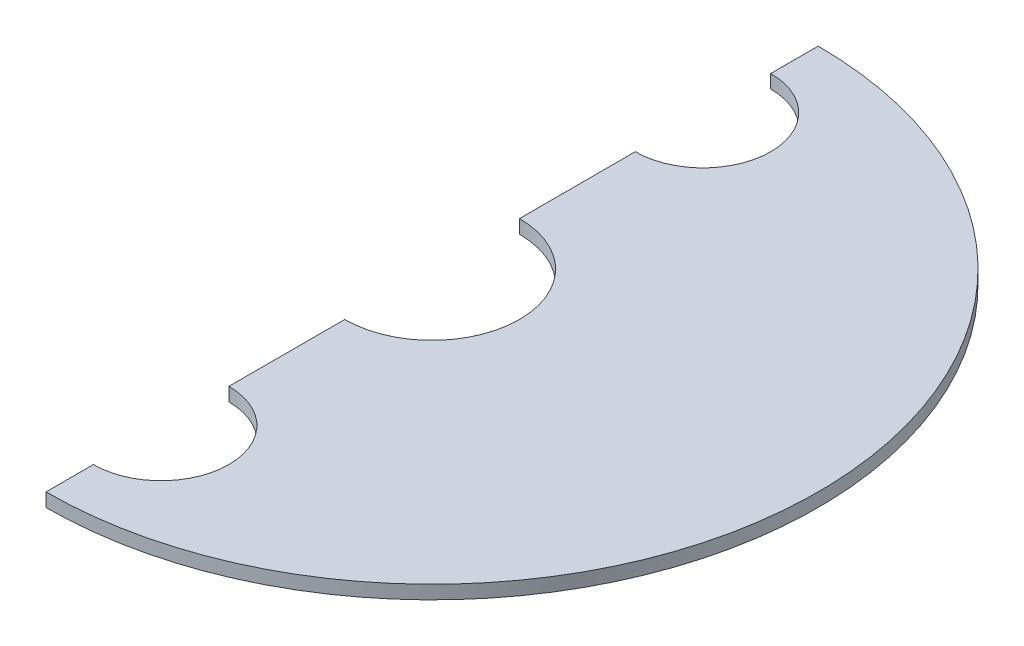
ISO-10303-21;
HEADER;
FILE_DESCRIPTION(('STEP AP214'),'2;1');
FILE_NAME('part.step','',(''),(''),'','','');
FILE_SCHEMA(('AUTOMOTIVE_DESIGN { 1 0 10303 214 1 1 1 1 }'));
ENDSEC;
DATA;
#1=APPLICATION_CONTEXT('core data for automotive mechanical design processes');
#2=APPLICATION_PROTOCOL_DEFINITION('international standard','automotive_design',2000,#1);
#3=PRODUCT_CONTEXT('',#1,'mechanical');
#4=PRODUCT('Part','Part','',(#3));
#5=PRODUCT_RELATED_PRODUCT_CATEGORY('part','',(#4));
#6=PRODUCT_DEFINITION_FORMATION('','',#4);
#7=PRODUCT_DEFINITION_CONTEXT('part definition',#1,'design');
#8=PRODUCT_DEFINITION('design','',#6,#7);
#9=PRODUCT_DEFINITION_SHAPE('','',#8);
#10=(LENGTH_UNIT() NAMED_UNIT(*) SI_UNIT(.MILLI.,.METRE.));
#11=(NAMED_UNIT(*) PLANE_ANGLE_UNIT() SI_UNIT($,.RADIAN.));
#12=(NAMED_UNIT(*) SI_UNIT($,.STERADIAN.) SOLID_ANGLE_UNIT());
#13=UNCERTAINTY_MEASURE_WITH_UNIT(LENGTH_MEASURE(1.E-05),#10,'distance_accuracy_value','');
#14=(GEOMETRIC_REPRESENTATION_CONTEXT(3) GLOBAL_UNCERTAINTY_ASSIGNED_CONTEXT((#13)) GLOBAL_UNIT_ASSIGNED_CONTEXT((#10,
#11,#12)) REPRESENTATION_CONTEXT('',''));
#15=CARTESIAN_POINT('',(0.,0.,0.));
#16=DIRECTION('',(0.,0.,1.));
#17=DIRECTION('',(1.,0.,0.));
#18=AXIS2_PLACEMENT_3D('',#15,#16,#17);
#19=CARTESIAN_POINT('',(0.,1.,-20.));
#20=DIRECTION('',(0.,-1.,0.));
#21=DIRECTION('',(0.,0.,-1.));
#22=AXIS2_PLACEMENT_3D('',#19,#20,#21);
#23=CYLINDRICAL_SURFACE('',#22,5.);
#24=CARTESIAN_POINT('',(0.,0.,-20.));
#25=DIRECTION('',(0.,1.,0.));
#26=DIRECTION('',(0.,0.,1.));
#27=AXIS2_PLACEMENT_3D('',#24,#25,#26);
#28=CIRCLE('',#27,5.);
#29=CARTESIAN_POINT('',(0.,0.,-15.));
#30=VERTEX_POINT('',#29);
#31=CARTESIAN_POINT('',(0.,0.,-25.));
#32=VERTEX_POINT('',#31);
#33=EDGE_CURVE('E138',#30,#32,#28,.T.);
#34=ORIENTED_EDGE('',*,*,#33,.F.);
#35=DIRECTION('',(0.,-1.,0.));
#36=VECTOR('',#35,1.);
#37=CARTESIAN_POINT('',(0.,1.,-15.));
#38=LINE('',#37,#36);
#39=CARTESIAN_POINT('',(0.,1.,-15.));
#40=VERTEX_POINT('',#39);
#41=EDGE_CURVE('E13',#40,#30,#38,.T.);
#42=ORIENTED_EDGE('',*,*,#41,.F.);
#43=CARTESIAN_POINT('',(0.,1.,-20.));
#44=DIRECTION('',(0.,1.,0.));
#45=DIRECTION('',(0.,0.,1.));
#46=AXIS2_PLACEMENT_3D('',#43,#44,#45);
#47=CIRCLE('',#46,5.);
#48=CARTESIAN_POINT('',(0.,1.,-25.));
#49=VERTEX_POINT('',#48);
#50=EDGE_CURVE('E157',#40,#49,#47,.T.);
#51=ORIENTED_EDGE('',*,*,#50,.T.);
#52=DIRECTION('',(0.,-1.,0.));
#53=VECTOR('',#52,1.);
#54=CARTESIAN_POINT('',(0.,1.,-25.));
#55=LINE('',#54,#53);
#56=EDGE_CURVE('E98',#49,#32,#55,.T.);
#57=ORIENTED_EDGE('',*,*,#56,.T.);
#58=EDGE_LOOP('',(#34,#42,#51,#57));
#59=FACE_BOUND('',#58,.T.);
#60=ADVANCED_FACE('F47',(#59),#23,.F.);
#61=CARTESIAN_POINT('',(0.,1.,0.));
#62=DIRECTION('',(-1.,0.,0.));
#63=DIRECTION('',(0.,0.,1.));
#64=AXIS2_PLACEMENT_3D('',#61,#62,#63);
#65=PLANE('',#64);
#66=DIRECTION('',(0.,0.,-1.));
#67=VECTOR('',#66,1.);
#68=CARTESIAN_POINT('',(0.,0.,0.));
#69=LINE('',#68,#67);
#70=CARTESIAN_POINT('',(0.,0.,-6.45));
#71=VERTEX_POINT('',#70);
#72=EDGE_CURVE('E141',#71,#30,#69,.T.);
#73=ORIENTED_EDGE('',*,*,#72,.F.);
#74=DIRECTION('',(0.,-1.,0.));
#75=VECTOR('',#74,1.);
#76=CARTESIAN_POINT('',(0.,1.,-6.45));
#77=LINE('',#76,#75);
#78=CARTESIAN_POINT('',(0.,1.,-6.45));
#79=VERTEX_POINT('',#78);
#80=EDGE_CURVE('E55',#79,#71,#77,.T.);
#81=ORIENTED_EDGE('',*,*,#80,.F.);
#82=DIRECTION('',(0.,0.,-1.));
#83=VECTOR('',#82,1.);
#84=CARTESIAN_POINT('',(0.,1.,0.));
#85=LINE('',#84,#83);
#86=EDGE_CURVE('E185',#79,#40,#85,.T.);
#87=ORIENTED_EDGE('',*,*,#86,.T.);
#88=ORIENTED_EDGE('',*,*,#41,.T.);
#89=EDGE_LOOP('',(#73,#81,#87,#88));
#90=FACE_BOUND('',#89,.T.);
#91=ADVANCED_FACE('F174',(#90),#65,.T.);
#92=CARTESIAN_POINT('',(0.,1.,0.));
#93=DIRECTION('',(0.,-1.,0.));
#94=DIRECTION('',(0.,0.,-1.));
#95=AXIS2_PLACEMENT_3D('',#92,#93,#94);
#96=CYLINDRICAL_SURFACE('',#95,6.45);
#97=CARTESIAN_POINT('',(0.,0.,0.));
#98=DIRECTION('',(0.,1.,0.));
#99=DIRECTION('',(0.,0.,1.));
#100=AXIS2_PLACEMENT_3D('',#97,#98,#99);
#101=CIRCLE('',#100,6.45);
#102=CARTESIAN_POINT('',(0.,0.,6.45));
#103=VERTEX_POINT('',#102);
#104=EDGE_CURVE('E144',#103,#71,#101,.T.);
#105=ORIENTED_EDGE('',*,*,#104,.F.);
#106=DIRECTION('',(0.,-1.,0.));
#107=VECTOR('',#106,1.);
#108=CARTESIAN_POINT('',(0.,1.,6.45));
#109=LINE('',#108,#107);
#110=CARTESIAN_POINT('',(0.,1.,6.45));
#111=VERTEX_POINT('',#110);
#112=EDGE_CURVE('E163',#111,#103,#109,.T.);
#113=ORIENTED_EDGE('',*,*,#112,.F.);
#114=CARTESIAN_POINT('',(0.,1.,0.));
#115=DIRECTION('',(0.,1.,0.));
#116=DIRECTION('',(0.,0.,1.));
#117=AXIS2_PLACEMENT_3D('',#114,#115,#116);
#118=CIRCLE('',#117,6.45);
#119=EDGE_CURVE('E170',#111,#79,#118,.T.);
#120=ORIENTED_EDGE('',*,*,#119,.T.);
#121=ORIENTED_EDGE('',*,*,#80,.T.);
#122=EDGE_LOOP('',(#105,#113,#120,#121));
#123=FACE_BOUND('',#122,.T.);
#124=ADVANCED_FACE('F168',(#123),#96,.F.);
#125=CARTESIAN_POINT('',(0.,1.,0.));
#126=DIRECTION('',(1.,0.,0.));
#127=DIRECTION('',(0.,0.,-1.));
#128=AXIS2_PLACEMENT_3D('',#125,#126,#127);
#129=PLANE('',#128);
#130=DIRECTION('',(0.,0.,1.));
#131=VECTOR('',#130,1.);
#132=CARTESIAN_POINT('',(0.,0.,0.));
#133=LINE('',#132,#131);
#134=CARTESIAN_POINT('',(0.,0.,15.));
#135=VERTEX_POINT('',#134);
#136=EDGE_CURVE('E147',#103,#135,#133,.T.);
#137=ORIENTED_EDGE('',*,*,#136,.T.);
#138=DIRECTION('',(0.,-1.,0.));
#139=VECTOR('',#138,1.);
#140=CARTESIAN_POINT('',(0.,1.,15.));
#141=LINE('',#140,#139);
#142=CARTESIAN_POINT('',(0.,1.,15.));
#143=VERTEX_POINT('',#142);
#144=EDGE_CURVE('E161',#143,#135,#141,.T.);
#145=ORIENTED_EDGE('',*,*,#144,.F.);
#146=DIRECTION('',(0.,0.,1.));
#147=VECTOR('',#146,1.);
#148=CARTESIAN_POINT('',(0.,1.,0.));
#149=LINE('',#148,#147);
#150=EDGE_CURVE('E183',#111,#143,#149,.T.);
#151=ORIENTED_EDGE('',*,*,#150,.F.);
#152=ORIENTED_EDGE('',*,*,#112,.T.);
#153=EDGE_LOOP('',(#137,#145,#151,#152));
#154=FACE_BOUND('',#153,.T.);
#155=ADVANCED_FACE('F181',(#154),#129,.F.);
#156=CARTESIAN_POINT('',(0.,1.,20.));
#157=DIRECTION('',(0.,-1.,0.));
#158=DIRECTION('',(0.,0.,-1.));
#159=AXIS2_PLACEMENT_3D('',#156,#157,#158);
#160=CYLINDRICAL_SURFACE('',#159,5.);
#161=CARTESIAN_POINT('',(0.,0.,20.));
#162=DIRECTION('',(0.,1.,0.));
#163=DIRECTION('',(0.,0.,1.));
#164=AXIS2_PLACEMENT_3D('',#161,#162,#163);
#165=CIRCLE('',#164,5.);
#166=CARTESIAN_POINT('',(0.,0.,25.));
#167=VERTEX_POINT('',#166);
#168=EDGE_CURVE('E150',#167,#135,#165,.T.);
#169=ORIENTED_EDGE('',*,*,#168,.F.);
#170=DIRECTION('',(0.,-1.,0.));
#171=VECTOR('',#170,1.);
#172=CARTESIAN_POINT('',(0.,1.,25.));
#173=LINE('',#172,#171);
#174=CARTESIAN_POINT('',(0.,1.,25.));
#175=VERTEX_POINT('',#174);
#176=EDGE_CURVE('E130',#175,#167,#173,.T.);
#177=ORIENTED_EDGE('',*,*,#176,.F.);
#178=CARTESIAN_POINT('',(0.,1.,20.));
#179=DIRECTION('',(0.,1.,0.));
#180=DIRECTION('',(0.,0.,1.));
#181=AXIS2_PLACEMENT_3D('',#178,#179,#180);
#182=CIRCLE('',#181,5.);
#183=EDGE_CURVE('E123',#175,#143,#182,.T.);
#184=ORIENTED_EDGE('',*,*,#183,.T.);
#185=ORIENTED_EDGE('',*,*,#144,.T.);
#186=EDGE_LOOP('',(#169,#177,#184,#185));
#187=FACE_BOUND('',#186,.T.);
#188=ADVANCED_FACE('F190',(#187),#160,.F.);
#189=CARTESIAN_POINT('',(0.,1.,0.));
#190=DIRECTION('',(1.,0.,0.));
#191=DIRECTION('',(0.,0.,-1.));
#192=AXIS2_PLACEMENT_3D('',#189,#190,#191);
#193=PLANE('',#192);
#194=DIRECTION('',(0.,0.,1.));
#195=VECTOR('',#194,1.);
#196=CARTESIAN_POINT('',(0.,0.,0.));
#197=LINE('',#196,#195);
#198=CARTESIAN_POINT('',(0.,0.,28.5));
#199=VERTEX_POINT('',#198);
#200=EDGE_CURVE('E129',#167,#199,#197,.T.);
#201=ORIENTED_EDGE('',*,*,#200,.T.);
#202=DIRECTION('',(0.,-1.,0.));
#203=VECTOR('',#202,1.);
#204=CARTESIAN_POINT('',(0.,1.,28.5));
#205=LINE('',#204,#203);
#206=CARTESIAN_POINT('',(0.,1.,28.5));
#207=VERTEX_POINT('',#206);
#208=EDGE_CURVE('E126',#207,#199,#205,.T.);
#209=ORIENTED_EDGE('',*,*,#208,.F.);
#210=DIRECTION('',(0.,0.,1.));
#211=VECTOR('',#210,1.);
#212=CARTESIAN_POINT('',(0.,1.,0.));
#213=LINE('',#212,#211);
#214=EDGE_CURVE('E117',#175,#207,#213,.T.);
#215=ORIENTED_EDGE('',*,*,#214,.F.);
#216=ORIENTED_EDGE('',*,*,#176,.T.);
#217=EDGE_LOOP('',(#201,#209,#215,#216));
#218=FACE_BOUND('',#217,.T.);
#219=ADVANCED_FACE('F127',(#218),#193,.F.);
#220=CARTESIAN_POINT('',(0.,1.,0.));
#221=DIRECTION('',(0.,-1.,0.));
#222=DIRECTION('',(0.,0.,-1.));
#223=AXIS2_PLACEMENT_3D('',#220,#221,#222);
#224=CYLINDRICAL_SURFACE('',#223,28.5);
#225=CARTESIAN_POINT('',(0.,0.,0.));
#226=DIRECTION('',(0.,1.,0.));
#227=DIRECTION('',(0.,0.,1.));
#228=AXIS2_PLACEMENT_3D('',#225,#226,#227);
#229=CIRCLE('',#228,28.5);
#230=CARTESIAN_POINT('',(0.,0.,-28.5));
#231=VERTEX_POINT('',#230);
#232=EDGE_CURVE('E91',#199,#231,#229,.T.);
#233=ORIENTED_EDGE('',*,*,#232,.T.);
#234=DIRECTION('',(0.,-1.,0.));
#235=VECTOR('',#234,1.);
#236=CARTESIAN_POINT('',(0.,1.,-28.5));
#237=LINE('',#236,#235);
#238=CARTESIAN_POINT('',(0.,1.,-28.5));
#239=VERTEX_POINT('',#238);
#240=EDGE_CURVE('E131',#239,#231,#237,.T.);
#241=ORIENTED_EDGE('',*,*,#240,.F.);
#242=CARTESIAN_POINT('',(0.,1.,0.));
#243=DIRECTION('',(0.,1.,0.));
#244=DIRECTION('',(0.,0.,1.));
#245=AXIS2_PLACEMENT_3D('',#242,#243,#244);
#246=CIRCLE('',#245,28.5);
#247=EDGE_CURVE('E121',#207,#239,#246,.T.);
#248=ORIENTED_EDGE('',*,*,#247,.F.);
#249=ORIENTED_EDGE('',*,*,#208,.T.);
#250=EDGE_LOOP('',(#233,#241,#248,#249));
#251=FACE_BOUND('',#250,.T.);
#252=ADVANCED_FACE('F133',(#251),#224,.T.);
#253=CARTESIAN_POINT('',(0.,1.,0.));
#254=DIRECTION('',(1.,0.,0.));
#255=DIRECTION('',(0.,0.,-1.));
#256=AXIS2_PLACEMENT_3D('',#253,#254,#255);
#257=PLANE('',#256);
#258=DIRECTION('',(0.,0.,1.));
#259=VECTOR('',#258,1.);
#260=CARTESIAN_POINT('',(0.,0.,0.));
#261=LINE('',#260,#259);
#262=EDGE_CURVE('E155',#231,#32,#261,.T.);
#263=ORIENTED_EDGE('',*,*,#262,.T.);
#264=ORIENTED_EDGE('',*,*,#56,.F.);
#265=DIRECTION('',(0.,0.,1.));
#266=VECTOR('',#265,1.);
#267=CARTESIAN_POINT('',(0.,1.,0.));
#268=LINE('',#267,#266);
#269=EDGE_CURVE('E63',#239,#49,#268,.T.);
#270=ORIENTED_EDGE('',*,*,#269,.F.);
#271=ORIENTED_EDGE('',*,*,#240,.T.);
#272=EDGE_LOOP('',(#263,#264,#270,#271));
#273=FACE_BOUND('',#272,.T.);
#274=ADVANCED_FACE('F193',(#273),#257,.F.);
#275=CARTESIAN_POINT('',(0.,1.,0.));
#276=DIRECTION('',(0.,1.,0.));
#277=DIRECTION('',(0.,0.,1.));
#278=AXIS2_PLACEMENT_3D('',#275,#276,#277);
#279=PLANE('',#278);
#280=ORIENTED_EDGE('',*,*,#50,.F.);
#281=ORIENTED_EDGE('',*,*,#86,.F.);
#282=ORIENTED_EDGE('',*,*,#119,.F.);
#283=ORIENTED_EDGE('',*,*,#150,.T.);
#284=ORIENTED_EDGE('',*,*,#183,.F.);
#285=ORIENTED_EDGE('',*,*,#214,.T.);
#286=ORIENTED_EDGE('',*,*,#247,.T.);
#287=ORIENTED_EDGE('',*,*,#269,.T.);
#288=EDGE_LOOP('',(#280,#281,#282,#283,#284,#285,#286,#287));
#289=FACE_BOUND('',#288,.T.);
#290=ADVANCED_FACE('F119',(#289),#279,.T.);
#291=CARTESIAN_POINT('',(0.,0.,0.));
#292=DIRECTION('',(0.,1.,0.));
#293=DIRECTION('',(0.,0.,1.));
#294=AXIS2_PLACEMENT_3D('',#291,#292,#293);
#295=PLANE('',#294);
#296=ORIENTED_EDGE('',*,*,#33,.T.);
#297=ORIENTED_EDGE('',*,*,#262,.F.);
#298=ORIENTED_EDGE('',*,*,#232,.F.);
#299=ORIENTED_EDGE('',*,*,#200,.F.);
#300=ORIENTED_EDGE('',*,*,#168,.T.);
#301=ORIENTED_EDGE('',*,*,#136,.F.);
#302=ORIENTED_EDGE('',*,*,#104,.T.);
#303=ORIENTED_EDGE('',*,*,#72,.T.);
#304=EDGE_LOOP('',(#296,#297,#298,#299,#300,#301,#302,#303));
#305=FACE_BOUND('',#304,.T.);
#306=ADVANCED_FACE('F177',(#305),#295,.F.);
#307=CLOSED_SHELL('',(#60,#91,#124,#155,#188,#219,#252,#274,#290,#306));
#308=MANIFOLD_SOLID_BREP('B2',#307);
#309=ADVANCED_BREP_SHAPE_REPRESENTATION('',(#18,#308),#14);
#310=SHAPE_DEFINITION_REPRESENTATION(#9,#309);
ENDSEC;
END-ISO-10303-21;
